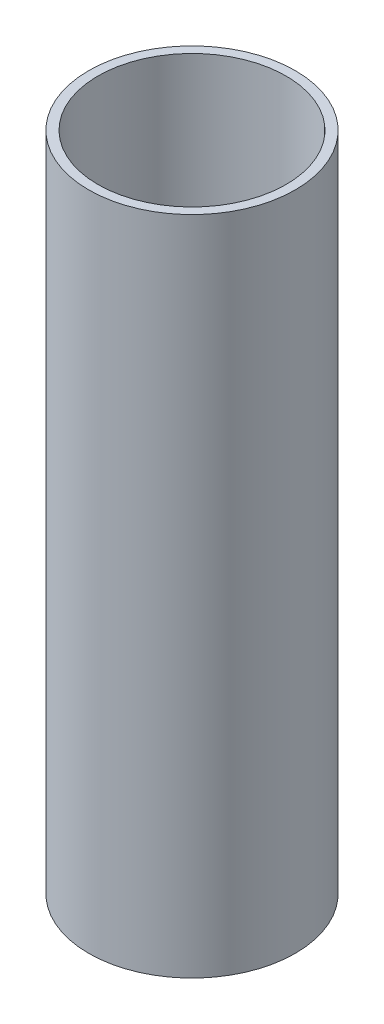
ISO-10303-21;
HEADER;
FILE_DESCRIPTION(('STEP AP214'),'2;1');
FILE_NAME('part.step','',(''),(''),'','','');
FILE_SCHEMA(('AUTOMOTIVE_DESIGN { 1 0 10303 214 1 1 1 1 }'));
ENDSEC;
DATA;
#1=APPLICATION_CONTEXT('core data for automotive mechanical design processes');
#2=APPLICATION_PROTOCOL_DEFINITION('international standard','automotive_design',2000,#1);
#3=PRODUCT_CONTEXT('',#1,'mechanical');
#4=PRODUCT('Part','Part','',(#3));
#5=PRODUCT_RELATED_PRODUCT_CATEGORY('part','',(#4));
#6=PRODUCT_DEFINITION_FORMATION('','',#4);
#7=PRODUCT_DEFINITION_CONTEXT('part definition',#1,'design');
#8=PRODUCT_DEFINITION('design','',#6,#7);
#9=PRODUCT_DEFINITION_SHAPE('','',#8);
#10=(LENGTH_UNIT() NAMED_UNIT(*) SI_UNIT(.MILLI.,.METRE.));
#11=(NAMED_UNIT(*) PLANE_ANGLE_UNIT() SI_UNIT($,.RADIAN.));
#12=(NAMED_UNIT(*) SI_UNIT($,.STERADIAN.) SOLID_ANGLE_UNIT());
#13=UNCERTAINTY_MEASURE_WITH_UNIT(LENGTH_MEASURE(1.E-05),#10,'distance_accuracy_value','');
#14=(GEOMETRIC_REPRESENTATION_CONTEXT(3) GLOBAL_UNCERTAINTY_ASSIGNED_CONTEXT((#13)) GLOBAL_UNIT_ASSIGNED_CONTEXT((#10,
#11,#12)) REPRESENTATION_CONTEXT('',''));
#15=CARTESIAN_POINT('',(0.,0.,0.));
#16=DIRECTION('',(0.,0.,1.));
#17=DIRECTION('',(1.,0.,0.));
#18=AXIS2_PLACEMENT_3D('',#15,#16,#17);
#19=CARTESIAN_POINT('',(0.,50.8,0.));
#20=DIRECTION('',(0.,1.,0.));
#21=DIRECTION('',(0.,0.,1.));
#22=AXIS2_PLACEMENT_3D('',#19,#20,#21);
#23=PLANE('',#22);
#24=CARTESIAN_POINT('',(0.,50.8,0.));
#25=DIRECTION('',(0.,1.,0.));
#26=DIRECTION('',(0.,0.,1.));
#27=AXIS2_PLACEMENT_3D('',#24,#25,#26);
#28=CIRCLE('',#27,7.9375);
#29=CARTESIAN_POINT('',(0.,50.8,7.9375));
#30=VERTEX_POINT('',#29);
#31=EDGE_CURVE('E10',#30,#30,#28,.T.);
#32=ORIENTED_EDGE('',*,*,#31,.T.);
#33=EDGE_LOOP('',(#32));
#34=FACE_BOUND('',#33,.T.);
#35=CARTESIAN_POINT('',(0.,50.8,0.));
#36=DIRECTION('',(0.,1.,0.));
#37=DIRECTION('',(0.,0.,1.));
#38=AXIS2_PLACEMENT_3D('',#35,#36,#37);
#39=CIRCLE('',#38,7.2263);
#40=CARTESIAN_POINT('',(0.,50.8,7.2263));
#41=VERTEX_POINT('',#40);
#42=EDGE_CURVE('E42',#41,#41,#39,.T.);
#43=ORIENTED_EDGE('',*,*,#42,.F.);
#44=EDGE_LOOP('',(#43));
#45=FACE_BOUND('',#44,.T.);
#46=ADVANCED_FACE('F31',(#34,#45),#23,.T.);
#47=CARTESIAN_POINT('',(0.,0.,0.));
#48=DIRECTION('',(0.,1.,0.));
#49=DIRECTION('',(0.,0.,1.));
#50=AXIS2_PLACEMENT_3D('',#47,#48,#49);
#51=PLANE('',#50);
#52=CARTESIAN_POINT('',(0.,0.,0.));
#53=DIRECTION('',(0.,1.,0.));
#54=DIRECTION('',(0.,0.,1.));
#55=AXIS2_PLACEMENT_3D('',#52,#53,#54);
#56=CIRCLE('',#55,7.9375);
#57=CARTESIAN_POINT('',(0.,0.,7.9375));
#58=VERTEX_POINT('',#57);
#59=EDGE_CURVE('E35',#58,#58,#56,.T.);
#60=ORIENTED_EDGE('',*,*,#59,.F.);
#61=EDGE_LOOP('',(#60));
#62=FACE_BOUND('',#61,.T.);
#63=CARTESIAN_POINT('',(0.,0.,0.));
#64=DIRECTION('',(0.,1.,0.));
#65=DIRECTION('',(0.,0.,1.));
#66=AXIS2_PLACEMENT_3D('',#63,#64,#65);
#67=CIRCLE('',#66,7.2263);
#68=CARTESIAN_POINT('',(0.,0.,7.2263));
#69=VERTEX_POINT('',#68);
#70=EDGE_CURVE('E44',#69,#69,#67,.T.);
#71=ORIENTED_EDGE('',*,*,#70,.T.);
#72=EDGE_LOOP('',(#71));
#73=FACE_BOUND('',#72,.T.);
#74=ADVANCED_FACE('F54',(#62,#73),#51,.F.);
#75=CARTESIAN_POINT('',(0.,50.8,0.));
#76=DIRECTION('',(0.,-1.,0.));
#77=DIRECTION('',(0.,0.,-1.));
#78=AXIS2_PLACEMENT_3D('',#75,#76,#77);
#79=CYLINDRICAL_SURFACE('',#78,7.9375);
#80=ORIENTED_EDGE('',*,*,#31,.F.);
#81=EDGE_LOOP('',(#80));
#82=FACE_BOUND('',#81,.T.);
#83=ORIENTED_EDGE('',*,*,#59,.T.);
#84=EDGE_LOOP('',(#83));
#85=FACE_BOUND('',#84,.T.);
#86=ADVANCED_FACE('F33',(#82,#85),#79,.T.);
#87=CARTESIAN_POINT('',(0.,50.8,0.));
#88=DIRECTION('',(0.,-1.,0.));
#89=DIRECTION('',(0.,0.,-1.));
#90=AXIS2_PLACEMENT_3D('',#87,#88,#89);
#91=CYLINDRICAL_SURFACE('',#90,7.2263);
#92=ORIENTED_EDGE('',*,*,#42,.T.);
#93=EDGE_LOOP('',(#92));
#94=FACE_BOUND('',#93,.T.);
#95=ORIENTED_EDGE('',*,*,#70,.F.);
#96=EDGE_LOOP('',(#95));
#97=FACE_BOUND('',#96,.T.);
#98=ADVANCED_FACE('F50',(#94,#97),#91,.F.);
#99=CLOSED_SHELL('',(#46,#74,#86,#98));
#100=MANIFOLD_SOLID_BREP('B2',#99);
#101=ADVANCED_BREP_SHAPE_REPRESENTATION('',(#18,#100),#14);
#102=SHAPE_DEFINITION_REPRESENTATION(#9,#101);
ENDSEC;
END-ISO-10303-21;
